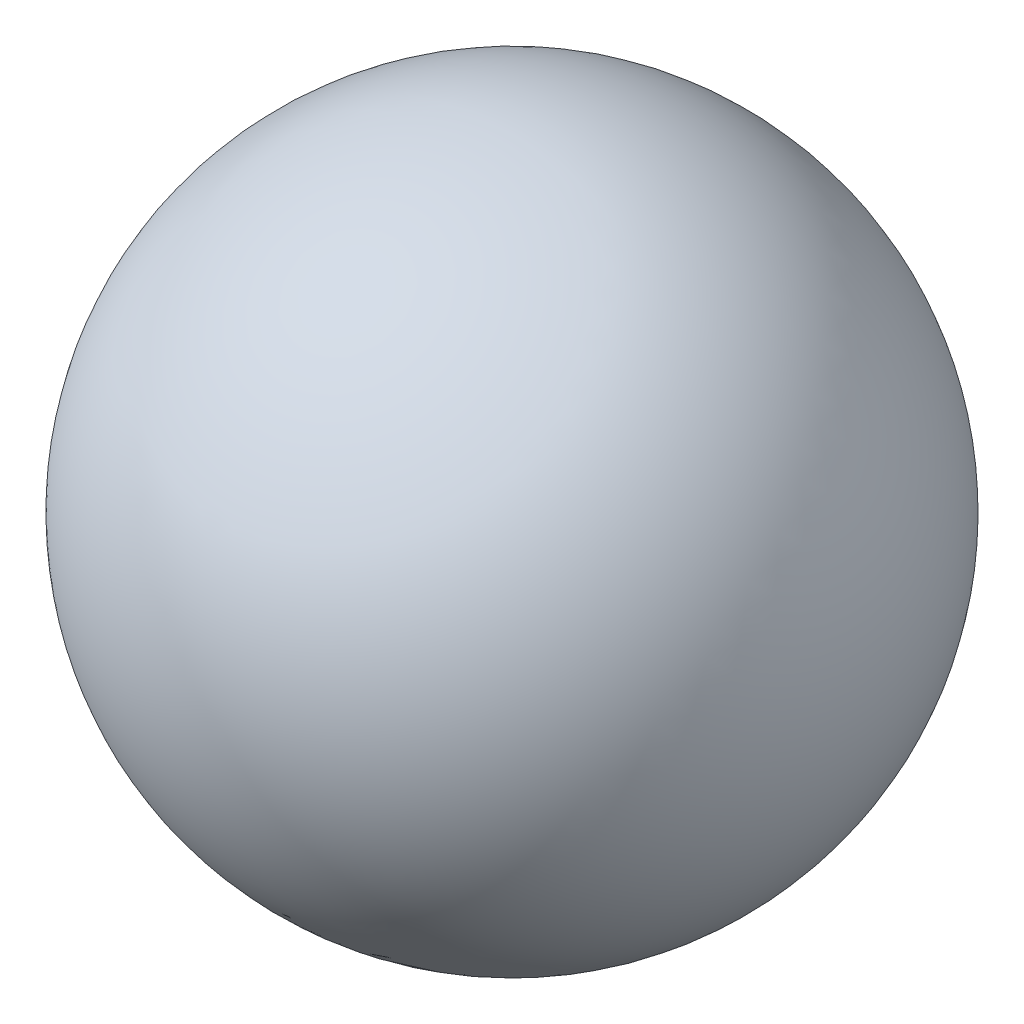
ISO-10303-21;
HEADER;
FILE_DESCRIPTION(('STEP AP214'),'2;1');
FILE_NAME('part.step','',(''),(''),'','','');
FILE_SCHEMA(('AUTOMOTIVE_DESIGN { 1 0 10303 214 1 1 1 1 }'));
ENDSEC;
DATA;
#1=APPLICATION_CONTEXT('core data for automotive mechanical design processes');
#2=APPLICATION_PROTOCOL_DEFINITION('international standard','automotive_design',2000,#1);
#3=PRODUCT_CONTEXT('',#1,'mechanical');
#4=PRODUCT('Part','Part','',(#3));
#5=PRODUCT_RELATED_PRODUCT_CATEGORY('part','',(#4));
#6=PRODUCT_DEFINITION_FORMATION('','',#4);
#7=PRODUCT_DEFINITION_CONTEXT('part definition',#1,'design');
#8=PRODUCT_DEFINITION('design','',#6,#7);
#9=PRODUCT_DEFINITION_SHAPE('','',#8);
#10=(LENGTH_UNIT() NAMED_UNIT(*) SI_UNIT(.MILLI.,.METRE.));
#11=(NAMED_UNIT(*) PLANE_ANGLE_UNIT() SI_UNIT($,.RADIAN.));
#12=(NAMED_UNIT(*) SI_UNIT($,.STERADIAN.) SOLID_ANGLE_UNIT());
#13=UNCERTAINTY_MEASURE_WITH_UNIT(LENGTH_MEASURE(1.E-05),#10,'distance_accuracy_value','');
#14=(GEOMETRIC_REPRESENTATION_CONTEXT(3) GLOBAL_UNCERTAINTY_ASSIGNED_CONTEXT((#13)) GLOBAL_UNIT_ASSIGNED_CONTEXT((#10,
#11,#12)) REPRESENTATION_CONTEXT('',''));
#15=CARTESIAN_POINT('',(0.,0.,0.));
#16=DIRECTION('',(0.,0.,1.));
#17=DIRECTION('',(1.,0.,0.));
#18=AXIS2_PLACEMENT_3D('',#15,#16,#17);
#19=CARTESIAN_POINT('',(67.76,27.0720048554601,63.8449865639891));
#20=DIRECTION('',(0.,0.390381842971414,0.920653038162718));
#21=DIRECTION('',(0.173648177666934,-0.906666249816888,0.384451065593442));
#22=AXIS2_PLACEMENT_3D('',#19,#20,#21);
#23=SPHERICAL_SURFACE('',#22,7.15);
#24=CARTESIAN_POINT('',(67.76,29.8632350327057,70.4276557868525));
#25=VERTEX_POINT('',#24);
#26=VERTEX_LOOP('',#25);
#27=FACE_BOUND('',#26,.T.);
#28=CARTESIAN_POINT('',(67.76,24.2807746782145,57.2623173411257));
#29=VERTEX_POINT('',#28);
#30=VERTEX_LOOP('',#29);
#31=FACE_BOUND('',#30,.T.);
#32=ADVANCED_FACE('F16',(#27,#31),#23,.T.);
#33=CLOSED_SHELL('',(#32));
#34=MANIFOLD_SOLID_BREP('B1',#33);
#35=ADVANCED_BREP_SHAPE_REPRESENTATION('',(#18,#34),#14);
#36=SHAPE_DEFINITION_REPRESENTATION(#9,#35);
ENDSEC;
END-ISO-10303-21;
